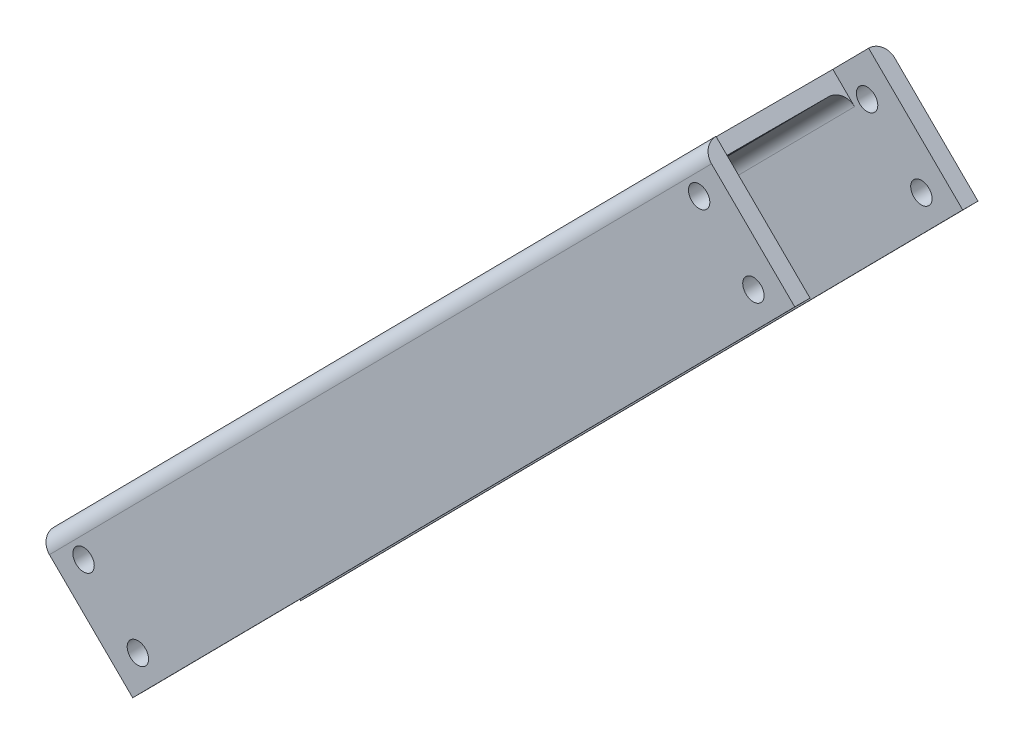
ISO-10303-21;
HEADER;
FILE_DESCRIPTION(('STEP AP214'),'2;1');
FILE_NAME('part.step','',(''),(''),'','','');
FILE_SCHEMA(('AUTOMOTIVE_DESIGN { 1 0 10303 214 1 1 1 1 }'));
ENDSEC;
DATA;
#1=APPLICATION_CONTEXT('core data for automotive mechanical design processes');
#2=APPLICATION_PROTOCOL_DEFINITION('international standard','automotive_design',2000,#1);
#3=PRODUCT_CONTEXT('',#1,'mechanical');
#4=PRODUCT('Part','Part','',(#3));
#5=PRODUCT_RELATED_PRODUCT_CATEGORY('part','',(#4));
#6=PRODUCT_DEFINITION_FORMATION('','',#4);
#7=PRODUCT_DEFINITION_CONTEXT('part definition',#1,'design');
#8=PRODUCT_DEFINITION('design','',#6,#7);
#9=PRODUCT_DEFINITION_SHAPE('','',#8);
#10=(LENGTH_UNIT() NAMED_UNIT(*) SI_UNIT(.MILLI.,.METRE.));
#11=(NAMED_UNIT(*) PLANE_ANGLE_UNIT() SI_UNIT($,.RADIAN.));
#12=(NAMED_UNIT(*) SI_UNIT($,.STERADIAN.) SOLID_ANGLE_UNIT());
#13=UNCERTAINTY_MEASURE_WITH_UNIT(LENGTH_MEASURE(1.E-05),#10,'distance_accuracy_value','');
#14=(GEOMETRIC_REPRESENTATION_CONTEXT(3) GLOBAL_UNCERTAINTY_ASSIGNED_CONTEXT((#13)) GLOBAL_UNIT_ASSIGNED_CONTEXT((#10,
#11,#12)) REPRESENTATION_CONTEXT('',''));
#15=CARTESIAN_POINT('',(0.,0.,0.));
#16=DIRECTION('',(0.,0.,1.));
#17=DIRECTION('',(1.,0.,0.));
#18=AXIS2_PLACEMENT_3D('',#15,#16,#17);
#19=CARTESIAN_POINT('',(165.715003735822,148.457007377639,-3.));
#20=DIRECTION('',(0.703127515212894,0.711063778679903,0.));
#21=DIRECTION('',(-0.711063778679903,0.703127515212894,0.));
#22=AXIS2_PLACEMENT_3D('',#19,#20,#21);
#23=PLANE('',#22);
#24=CARTESIAN_POINT('',(167.848195071861,146.347624832,-33.));
#25=DIRECTION('',(0.703127515212894,0.711063778679903,0.));
#26=DIRECTION('',(-0.711063778679903,0.703127515212894,0.));
#27=AXIS2_PLACEMENT_3D('',#24,#25,#26);
#28=CIRCLE('',#27,3.);
#29=CARTESIAN_POINT('',(167.848195071861,146.347624832,-36.));
#30=VERTEX_POINT('',#29);
#31=CARTESIAN_POINT('',(165.715003735822,148.457007377639,-33.));
#32=VERTEX_POINT('',#31);
#33=EDGE_CURVE('E159',#30,#32,#28,.T.);
#34=ORIENTED_EDGE('',*,*,#33,.T.);
#35=DIRECTION('',(0.711063778679903,-0.703127515212894,0.));
#36=VECTOR('',#35,1.);
#37=CARTESIAN_POINT('',(165.715003735822,148.457007377639,-33.));
#38=LINE('',#37,#36);
#39=CARTESIAN_POINT('',(184.202661981499,130.175691982104,-33.));
#40=VERTEX_POINT('',#39);
#41=EDGE_CURVE('E558',#32,#40,#38,.T.);
#42=ORIENTED_EDGE('',*,*,#41,.T.);
#43=DIRECTION('',(0.,0.,-1.));
#44=VECTOR('',#43,1.);
#45=CARTESIAN_POINT('',(184.202661981499,130.175691982104,-33.));
#46=LINE('',#45,#44);
#47=CARTESIAN_POINT('',(184.202661981499,130.175691982104,-36.));
#48=VERTEX_POINT('',#47);
#49=EDGE_CURVE('E565',#40,#48,#46,.T.);
#50=ORIENTED_EDGE('',*,*,#49,.T.);
#51=DIRECTION('',(0.711063778679903,-0.703127515212894,0.));
#52=VECTOR('',#51,1.);
#53=CARTESIAN_POINT('',(165.715003735822,148.457007377639,-36.));
#54=LINE('',#53,#52);
#55=EDGE_CURVE('E557',#30,#48,#54,.T.);
#56=ORIENTED_EDGE('',*,*,#55,.F.);
#57=EDGE_LOOP('',(#34,#42,#50,#56));
#58=FACE_BOUND('',#57,.T.);
#59=ADVANCED_FACE('F32',(#58),#23,.T.);
#60=CARTESIAN_POINT('',(35.6364134214364,16.9102083218567,-3.));
#61=DIRECTION('',(-0.703127515212895,-0.711063778679901,0.));
#62=DIRECTION('',(0.711063778679901,-0.703127515212895,0.));
#63=AXIS2_PLACEMENT_3D('',#60,#61,#62);
#64=PLANE('',#63);
#65=CARTESIAN_POINT('',(37.7696047574761,14.800825776218,-3.));
#66=DIRECTION('',(-0.703127515212895,-0.711063778679901,0.));
#67=DIRECTION('',(0.711063778679901,-0.703127515212895,0.));
#68=AXIS2_PLACEMENT_3D('',#65,#66,#67);
#69=CIRCLE('',#68,3.);
#70=CARTESIAN_POINT('',(37.7696047574761,14.800825776218,0.));
#71=VERTEX_POINT('',#70);
#72=CARTESIAN_POINT('',(35.6364134214364,16.9102083218567,-3.));
#73=VERTEX_POINT('',#72);
#74=EDGE_CURVE('E55',#71,#73,#69,.T.);
#75=ORIENTED_EDGE('',*,*,#74,.T.);
#76=DIRECTION('',(0.711063778679901,-0.703127515212895,0.));
#77=VECTOR('',#76,1.);
#78=CARTESIAN_POINT('',(35.6364134214364,16.9102083218567,-3.));
#79=LINE('',#78,#77);
#80=CARTESIAN_POINT('',(54.1240716671134,-1.37110707367817,-3.));
#81=VERTEX_POINT('',#80);
#82=EDGE_CURVE('E145',#73,#81,#79,.T.);
#83=ORIENTED_EDGE('',*,*,#82,.T.);
#84=DIRECTION('',(0.,0.,1.));
#85=VECTOR('',#84,1.);
#86=CARTESIAN_POINT('',(54.1240716671134,-1.37110707367817,-3.));
#87=LINE('',#86,#85);
#88=CARTESIAN_POINT('',(54.1240716671134,-1.37110707367817,0.));
#89=VERTEX_POINT('',#88);
#90=EDGE_CURVE('E580',#81,#89,#87,.T.);
#91=ORIENTED_EDGE('',*,*,#90,.T.);
#92=DIRECTION('',(0.711063778679901,-0.703127515212895,0.));
#93=VECTOR('',#92,1.);
#94=CARTESIAN_POINT('',(35.6364134214364,16.9102083218567,0.));
#95=LINE('',#94,#93);
#96=EDGE_CURVE('E582',#71,#89,#95,.T.);
#97=ORIENTED_EDGE('',*,*,#96,.F.);
#98=EDGE_LOOP('',(#75,#83,#91,#97));
#99=FACE_BOUND('',#98,.T.);
#100=ADVANCED_FACE('F211',(#99),#64,.T.);
#101=CARTESIAN_POINT('',(0.,0.,-3.));
#102=DIRECTION('',(0.,0.,1.));
#103=DIRECTION('',(1.,0.,0.));
#104=AXIS2_PLACEMENT_3D('',#101,#102,#103);
#105=PLANE('',#104);
#106=CARTESIAN_POINT('',(176.077014239216,129.069414996749,-3.));
#107=DIRECTION('',(0.,0.,1.));
#108=DIRECTION('',(1.,0.,0.));
#109=AXIS2_PLACEMENT_3D('',#106,#107,#108);
#110=CIRCLE('',#109,2.1);
#111=CARTESIAN_POINT('',(178.177014239216,129.069414996749,-3.));
#112=VERTEX_POINT('',#111);
#113=EDGE_CURVE('E518',#112,#112,#110,.T.);
#114=ORIENTED_EDGE('',*,*,#113,.T.);
#115=EDGE_LOOP('',(#114));
#116=FACE_BOUND('',#115,.T.);
#117=CARTESIAN_POINT('',(165.411057559017,139.616327724942,-3.));
#118=DIRECTION('',(0.,0.,1.));
#119=DIRECTION('',(1.,0.,0.));
#120=AXIS2_PLACEMENT_3D('',#117,#118,#119);
#121=CIRCLE('',#120,2.10000000000002);
#122=CARTESIAN_POINT('',(167.511057559017,139.616327724942,-3.));
#123=VERTEX_POINT('',#122);
#124=EDGE_CURVE('E526',#123,#123,#121,.T.);
#125=ORIENTED_EDGE('',*,*,#124,.T.);
#126=EDGE_LOOP('',(#125));
#127=FACE_BOUND('',#126,.T.);
#128=CARTESIAN_POINT('',(44.473124942399,17.3133577919994,-3.));
#129=DIRECTION('',(0.,0.,1.));
#130=DIRECTION('',(1.,0.,0.));
#131=AXIS2_PLACEMENT_3D('',#128,#129,#130);
#132=CIRCLE('',#131,2.1);
#133=CARTESIAN_POINT('',(46.573124942399,17.3133577919994,-3.));
#134=VERTEX_POINT('',#133);
#135=EDGE_CURVE('E629',#134,#134,#132,.T.);
#136=ORIENTED_EDGE('',*,*,#135,.T.);
#137=EDGE_LOOP('',(#136));
#138=FACE_BOUND('',#137,.T.);
#139=CARTESIAN_POINT('',(55.1390816225975,6.76644506380587,-3.));
#140=DIRECTION('',(0.,0.,1.));
#141=DIRECTION('',(1.,0.,0.));
#142=AXIS2_PLACEMENT_3D('',#139,#140,#141);
#143=CIRCLE('',#142,2.1);
#144=CARTESIAN_POINT('',(57.2390816225975,6.76644506380587,-3.));
#145=VERTEX_POINT('',#144);
#146=EDGE_CURVE('E635',#145,#145,#143,.T.);
#147=ORIENTED_EDGE('',*,*,#146,.T.);
#148=EDGE_LOOP('',(#147));
#149=FACE_BOUND('',#148,.T.);
#150=DIRECTION('',(-0.703127515212894,-0.711063778679903,0.));
#151=VECTOR('',#150,1.);
#152=CARTESIAN_POINT('',(169.981386407901,144.238242286361,-3.));
#153=LINE('',#152,#151);
#154=CARTESIAN_POINT('',(46.9340712456447,19.8020810173784,-3.));
#155=VERTEX_POINT('',#154);
#156=CARTESIAN_POINT('',(162.950111255772,137.127604499562,-3.));
#157=VERTEX_POINT('',#156);
#158=EDGE_CURVE('E595',#155,#157,#153,.F.);
#159=ORIENTED_EDGE('',*,*,#158,.T.);
#160=DIRECTION('',(-0.711063778679903,0.703127515212894,0.));
#161=VECTOR('',#160,1.);
#162=CARTESIAN_POINT('',(199.657197852114,100.83020985923,-3.));
#163=LINE('',#162,#161);
#164=CARTESIAN_POINT('',(158.683728583693,141.34636959084,-3.));
#165=VERTEX_POINT('',#164);
#166=EDGE_CURVE('E152',#157,#165,#163,.T.);
#167=ORIENTED_EDGE('',*,*,#166,.T.);
#168=DIRECTION('',(0.703127515212892,0.711063778679904,0.));
#169=VECTOR('',#168,1.);
#170=CARTESIAN_POINT('',(158.683728583693,141.34636959084,-3.));
#171=LINE('',#170,#169);
#172=CARTESIAN_POINT('',(165.715003735822,148.457007377639,-3.));
#173=VERTEX_POINT('',#172);
#174=EDGE_CURVE('E149',#165,#173,#171,.T.);
#175=ORIENTED_EDGE('',*,*,#174,.T.);
#176=DIRECTION('',(-0.711063778679903,0.703127515212894,0.));
#177=VECTOR('',#176,1.);
#178=CARTESIAN_POINT('',(165.715003735822,148.457007377639,-3.));
#179=LINE('',#178,#177);
#180=CARTESIAN_POINT('',(184.202661981499,130.175691982104,-3.));
#181=VERTEX_POINT('',#180);
#182=EDGE_CURVE('E135',#181,#173,#179,.T.);
#183=ORIENTED_EDGE('',*,*,#182,.F.);
#184=DIRECTION('',(0.703127515212895,0.711063778679901,0.));
#185=VECTOR('',#184,1.);
#186=CARTESIAN_POINT('',(54.1240716671134,-1.37110707367817,-3.));
#187=LINE('',#186,#185);
#188=EDGE_CURVE('E578',#81,#181,#187,.T.);
#189=ORIENTED_EDGE('',*,*,#188,.F.);
#190=ORIENTED_EDGE('',*,*,#82,.F.);
#191=DIRECTION('',(-0.703127515212894,-0.711063778679903,0.));
#192=VECTOR('',#191,1.);
#193=CARTESIAN_POINT('',(165.715003735822,148.457007377639,-3.));
#194=LINE('',#193,#192);
#195=CARTESIAN_POINT('',(42.6676885735653,24.0208461086557,-3.));
#196=VERTEX_POINT('',#195);
#197=EDGE_CURVE('E170',#73,#196,#194,.F.);
#198=ORIENTED_EDGE('',*,*,#197,.T.);
#199=DIRECTION('',(-0.711063778679903,0.703127515212894,0.));
#200=VECTOR('',#199,1.);
#201=CARTESIAN_POINT('',(83.6411578419864,-16.4953136229538,-3.));
#202=LINE('',#201,#200);
#203=EDGE_CURVE('E536',#155,#196,#202,.T.);
#204=ORIENTED_EDGE('',*,*,#203,.F.);
#205=EDGE_LOOP('',(#159,#167,#175,#183,#189,#190,#198,#204));
#206=FACE_BOUND('',#205,.T.);
#207=ADVANCED_FACE('F151',(#116,#127,#138,#149,#206),#105,.F.);
#208=ORIENTED_EDGE('',*,*,#182,.T.);
#209=CARTESIAN_POINT('',(167.848195071861,146.347624832,-3.));
#210=DIRECTION('',(0.703127515212894,0.711063778679903,0.));
#211=DIRECTION('',(-0.711063778679903,0.703127515212894,0.));
#212=AXIS2_PLACEMENT_3D('',#209,#210,#211);
#213=CIRCLE('',#212,3.);
#214=CARTESIAN_POINT('',(167.848195071861,146.347624832,0.));
#215=VERTEX_POINT('',#214);
#216=EDGE_CURVE('E140',#173,#215,#213,.T.);
#217=ORIENTED_EDGE('',*,*,#216,.T.);
#218=DIRECTION('',(-0.711063778679903,0.703127515212894,0.));
#219=VECTOR('',#218,1.);
#220=CARTESIAN_POINT('',(165.715003735822,148.457007377639,0.));
#221=LINE('',#220,#219);
#222=CARTESIAN_POINT('',(184.202661981499,130.175691982104,0.));
#223=VERTEX_POINT('',#222);
#224=EDGE_CURVE('E574',#223,#215,#221,.T.);
#225=ORIENTED_EDGE('',*,*,#224,.F.);
#226=DIRECTION('',(0.,0.,1.));
#227=VECTOR('',#226,1.);
#228=CARTESIAN_POINT('',(184.202661981499,130.175691982104,-3.));
#229=LINE('',#228,#227);
#230=EDGE_CURVE('E142',#181,#223,#229,.T.);
#231=ORIENTED_EDGE('',*,*,#230,.F.);
#232=EDGE_LOOP('',(#208,#217,#225,#231));
#233=FACE_BOUND('',#232,.T.);
#234=ADVANCED_FACE('F137',(#233),#23,.T.);
#235=CARTESIAN_POINT('',(54.1240716671134,-1.37110707367817,-3.));
#236=DIRECTION('',(0.711063778679901,-0.703127515212896,0.));
#237=DIRECTION('',(0.703127515212896,0.711063778679901,0.));
#238=AXIS2_PLACEMENT_3D('',#235,#236,#237);
#239=PLANE('',#238);
#240=DIRECTION('',(0.703127515212895,0.711063778679901,0.));
#241=VECTOR('',#240,1.);
#242=CARTESIAN_POINT('',(54.1240716671134,-1.37110707367817,0.));
#243=LINE('',#242,#241);
#244=EDGE_CURVE('E146',#89,#223,#243,.T.);
#245=ORIENTED_EDGE('',*,*,#244,.F.);
#246=ORIENTED_EDGE('',*,*,#90,.F.);
#247=ORIENTED_EDGE('',*,*,#188,.T.);
#248=ORIENTED_EDGE('',*,*,#230,.T.);
#249=EDGE_LOOP('',(#245,#246,#247,#248));
#250=FACE_BOUND('',#249,.T.);
#251=ADVANCED_FACE('F223',(#250),#239,.T.);
#252=DIRECTION('',(-0.711063778679901,0.703127515212895,0.));
#253=VECTOR('',#252,1.);
#254=CARTESIAN_POINT('',(54.1240716671134,-1.37110707367817,-33.));
#255=LINE('',#254,#253);
#256=CARTESIAN_POINT('',(54.1240716671134,-1.37110707367817,-33.));
#257=VERTEX_POINT('',#256);
#258=CARTESIAN_POINT('',(35.6364134214364,16.9102083218567,-32.9999999999998));
#259=VERTEX_POINT('',#258);
#260=EDGE_CURVE('E563',#257,#259,#255,.T.);
#261=ORIENTED_EDGE('',*,*,#260,.T.);
#262=CARTESIAN_POINT('',(37.7696047574761,14.800825776218,-33.));
#263=DIRECTION('',(-0.703127515212895,-0.711063778679901,0.));
#264=DIRECTION('',(0.711063778679901,-0.703127515212895,0.));
#265=AXIS2_PLACEMENT_3D('',#262,#263,#264);
#266=CIRCLE('',#265,3.);
#267=CARTESIAN_POINT('',(37.7696047574761,14.800825776218,-36.));
#268=VERTEX_POINT('',#267);
#269=EDGE_CURVE('E178',#259,#268,#266,.T.);
#270=ORIENTED_EDGE('',*,*,#269,.T.);
#271=DIRECTION('',(-0.711063778679901,0.703127515212895,0.));
#272=VECTOR('',#271,1.);
#273=CARTESIAN_POINT('',(54.1240716671134,-1.37110707367817,-36.));
#274=LINE('',#273,#272);
#275=CARTESIAN_POINT('',(54.1240716671134,-1.37110707367817,-36.));
#276=VERTEX_POINT('',#275);
#277=EDGE_CURVE('E561',#276,#268,#274,.T.);
#278=ORIENTED_EDGE('',*,*,#277,.F.);
#279=DIRECTION('',(0.,0.,-1.));
#280=VECTOR('',#279,1.);
#281=CARTESIAN_POINT('',(54.1240716671134,-1.37110707367817,-33.));
#282=LINE('',#281,#280);
#283=EDGE_CURVE('E572',#257,#276,#282,.T.);
#284=ORIENTED_EDGE('',*,*,#283,.F.);
#285=EDGE_LOOP('',(#261,#270,#278,#284));
#286=FACE_BOUND('',#285,.T.);
#287=ADVANCED_FACE('F219',(#286),#64,.T.);
#288=CARTESIAN_POINT('',(165.715003735822,148.457007377639,-3.));
#289=DIRECTION('',(-0.711063778679903,0.703127515212893,0.));
#290=DIRECTION('',(-0.703127515212894,-0.711063778679903,0.));
#291=AXIS2_PLACEMENT_3D('',#288,#289,#290);
#292=PLANE('',#291);
#293=CARTESIAN_POINT('',(148.136815855499,130.680412910641,-18.));
#294=DIRECTION('',(-0.711063778679903,0.703127515212893,0.));
#295=DIRECTION('',(-0.703127515212894,-0.711063778679903,0.));
#296=AXIS2_PLACEMENT_3D('',#293,#294,#295);
#297=CIRCLE('',#296,8.5);
#298=CARTESIAN_POINT('',(142.16023197619,124.636370791862,-18.));
#299=VERTEX_POINT('',#298);
#300=EDGE_CURVE('E40',#299,#299,#297,.F.);
#301=ORIENTED_EDGE('',*,*,#300,.T.);
#302=EDGE_LOOP('',(#301));
#303=FACE_BOUND('',#302,.T.);
#304=DIRECTION('',(0.,0.,1.));
#305=VECTOR('',#304,1.);
#306=CARTESIAN_POINT('',(158.683728583693,141.34636959084,-33.));
#307=LINE('',#306,#305);
#308=CARTESIAN_POINT('',(158.683728583693,141.34636959084,-33.));
#309=VERTEX_POINT('',#308);
#310=EDGE_CURVE('E47',#309,#165,#307,.T.);
#311=ORIENTED_EDGE('',*,*,#310,.F.);
#312=DIRECTION('',(0.703127515212894,0.711063778679903,0.));
#313=VECTOR('',#312,1.);
#314=CARTESIAN_POINT('',(165.715003735822,148.457007377639,-33.));
#315=LINE('',#314,#313);
#316=CARTESIAN_POINT('',(42.6676885735653,24.0208461086557,-33.));
#317=VERTEX_POINT('',#316);
#318=EDGE_CURVE('E173',#309,#317,#315,.F.);
#319=ORIENTED_EDGE('',*,*,#318,.T.);
#320=DIRECTION('',(0.,0.,-1.));
#321=VECTOR('',#320,1.);
#322=CARTESIAN_POINT('',(42.6676885735653,24.0208461086557,-33.));
#323=LINE('',#322,#321);
#324=EDGE_CURVE('E523',#196,#317,#323,.T.);
#325=ORIENTED_EDGE('',*,*,#324,.F.);
#326=EDGE_CURVE('E163',#196,#165,#194,.F.);
#327=ORIENTED_EDGE('',*,*,#326,.T.);
#328=EDGE_LOOP('',(#311,#319,#325,#327));
#329=FACE_BOUND('',#328,.T.);
#330=ADVANCED_FACE('F189',(#303,#329),#292,.T.);
#331=CARTESIAN_POINT('',(0.,0.,0.));
#332=DIRECTION('',(0.,0.,1.));
#333=DIRECTION('',(1.,0.,0.));
#334=AXIS2_PLACEMENT_3D('',#331,#332,#333);
#335=PLANE('',#334);
#336=CARTESIAN_POINT('',(176.077014239216,129.069414996749,0.));
#337=DIRECTION('',(0.,0.,1.));
#338=DIRECTION('',(1.,0.,0.));
#339=AXIS2_PLACEMENT_3D('',#336,#337,#338);
#340=CIRCLE('',#339,2.1);
#341=CARTESIAN_POINT('',(178.177014239216,129.069414996749,0.));
#342=VERTEX_POINT('',#341);
#343=EDGE_CURVE('E516',#342,#342,#340,.T.);
#344=ORIENTED_EDGE('',*,*,#343,.F.);
#345=EDGE_LOOP('',(#344));
#346=FACE_BOUND('',#345,.T.);
#347=CARTESIAN_POINT('',(165.411057559017,139.616327724942,0.));
#348=DIRECTION('',(0.,0.,1.));
#349=DIRECTION('',(1.,0.,0.));
#350=AXIS2_PLACEMENT_3D('',#347,#348,#349);
#351=CIRCLE('',#350,2.10000000000002);
#352=CARTESIAN_POINT('',(167.511057559017,139.616327724942,0.));
#353=VERTEX_POINT('',#352);
#354=EDGE_CURVE('E652',#353,#353,#351,.T.);
#355=ORIENTED_EDGE('',*,*,#354,.F.);
#356=EDGE_LOOP('',(#355));
#357=FACE_BOUND('',#356,.T.);
#358=CARTESIAN_POINT('',(44.473124942399,17.3133577919994,0.));
#359=DIRECTION('',(0.,0.,1.));
#360=DIRECTION('',(-1.,0.,0.));
#361=AXIS2_PLACEMENT_3D('',#358,#359,#360);
#362=CIRCLE('',#361,2.1);
#363=CARTESIAN_POINT('',(42.373124942399,17.3133577919994,0.));
#364=VERTEX_POINT('',#363);
#365=EDGE_CURVE('E645',#364,#364,#362,.T.);
#366=ORIENTED_EDGE('',*,*,#365,.F.);
#367=EDGE_LOOP('',(#366));
#368=FACE_BOUND('',#367,.T.);
#369=CARTESIAN_POINT('',(55.1390816225975,6.76644506380587,0.));
#370=DIRECTION('',(0.,0.,1.));
#371=DIRECTION('',(-1.,0.,0.));
#372=AXIS2_PLACEMENT_3D('',#369,#370,#371);
#373=CIRCLE('',#372,2.1);
#374=CARTESIAN_POINT('',(53.0390816225975,6.76644506380587,0.));
#375=VERTEX_POINT('',#374);
#376=EDGE_CURVE('E646',#375,#375,#373,.T.);
#377=ORIENTED_EDGE('',*,*,#376,.F.);
#378=EDGE_LOOP('',(#377));
#379=FACE_BOUND('',#378,.T.);
#380=ORIENTED_EDGE('',*,*,#224,.T.);
#381=DIRECTION('',(-0.703127515212894,-0.711063778679903,0.));
#382=VECTOR('',#381,1.);
#383=CARTESIAN_POINT('',(11.6968071912389,-11.5662577997837,0.));
#384=LINE('',#383,#382);
#385=EDGE_CURVE('E158',#215,#71,#384,.T.);
#386=ORIENTED_EDGE('',*,*,#385,.T.);
#387=ORIENTED_EDGE('',*,*,#96,.T.);
#388=ORIENTED_EDGE('',*,*,#244,.T.);
#389=EDGE_LOOP('',(#380,#386,#387,#388));
#390=FACE_BOUND('',#389,.T.);
#391=ADVANCED_FACE('F240',(#346,#357,#368,#379,#390),#335,.T.);
#392=CARTESIAN_POINT('',(37.7696047574761,14.800825776218,-220.999814062279));
#393=DIRECTION('',(-0.711063778679903,0.703127515212893,0.));
#394=DIRECTION('',(-0.703127515212894,-0.711063778679903,0.));
#395=AXIS2_PLACEMENT_3D('',#392,#393,#394);
#396=PLANE('',#395);
#397=CARTESIAN_POINT('',(150.270007191539,128.571030365002,-18.));
#398=DIRECTION('',(-0.711063778679903,0.703127515212893,0.));
#399=DIRECTION('',(-0.703127515212894,-0.711063778679903,0.));
#400=AXIS2_PLACEMENT_3D('',#397,#398,#399);
#401=CIRCLE('',#400,8.5);
#402=CARTESIAN_POINT('',(144.293423312229,122.526988246223,-18.));
#403=VERTEX_POINT('',#402);
#404=EDGE_CURVE('E11',#403,#403,#401,.T.);
#405=ORIENTED_EDGE('',*,*,#404,.T.);
#406=EDGE_LOOP('',(#405));
#407=FACE_BOUND('',#406,.T.);
#408=DIRECTION('',(-0.703127515212894,-0.711063778679903,0.));
#409=VECTOR('',#408,1.);
#410=CARTESIAN_POINT('',(167.848195071861,146.347624832,-30.));
#411=LINE('',#410,#409);
#412=CARTESIAN_POINT('',(44.800879909605,21.911463563017,-30.));
#413=VERTEX_POINT('',#412);
#414=CARTESIAN_POINT('',(160.816919919732,139.236987045201,-30.));
#415=VERTEX_POINT('',#414);
#416=EDGE_CURVE('E587',#413,#415,#411,.F.);
#417=ORIENTED_EDGE('',*,*,#416,.T.);
#418=DIRECTION('',(0.,0.,1.));
#419=VECTOR('',#418,1.);
#420=CARTESIAN_POINT('',(160.816919919732,139.236987045201,-220.999814062279));
#421=LINE('',#420,#419);
#422=CARTESIAN_POINT('',(160.816919919732,139.236987045201,-6.00000000000001));
#423=VERTEX_POINT('',#422);
#424=EDGE_CURVE('E551',#415,#423,#421,.T.);
#425=ORIENTED_EDGE('',*,*,#424,.T.);
#426=DIRECTION('',(-0.703127515212894,-0.711063778679903,0.));
#427=VECTOR('',#426,1.);
#428=CARTESIAN_POINT('',(37.7696047574761,14.800825776218,-6.00000000000001));
#429=LINE('',#428,#427);
#430=CARTESIAN_POINT('',(44.800879909605,21.911463563017,-6.00000000000001));
#431=VERTEX_POINT('',#430);
#432=EDGE_CURVE('E592',#423,#431,#429,.T.);
#433=ORIENTED_EDGE('',*,*,#432,.T.);
#434=DIRECTION('',(0.,0.,-1.));
#435=VECTOR('',#434,1.);
#436=CARTESIAN_POINT('',(44.800879909605,21.911463563017,-220.999814062279));
#437=LINE('',#436,#435);
#438=EDGE_CURVE('E542',#431,#413,#437,.T.);
#439=ORIENTED_EDGE('',*,*,#438,.T.);
#440=EDGE_LOOP('',(#417,#425,#433,#439));
#441=FACE_BOUND('',#440,.T.);
#442=ADVANCED_FACE('F238',(#407,#441),#396,.F.);
#443=CARTESIAN_POINT('',(0.,0.,-33.));
#444=DIRECTION('',(0.,0.,-1.));
#445=DIRECTION('',(-1.,0.,0.));
#446=AXIS2_PLACEMENT_3D('',#443,#444,#445);
#447=PLANE('',#446);
#448=CARTESIAN_POINT('',(176.077014239216,129.069414996749,-33.));
#449=DIRECTION('',(0.,0.,-1.));
#450=DIRECTION('',(-1.,0.,0.));
#451=AXIS2_PLACEMENT_3D('',#448,#449,#450);
#452=CIRCLE('',#451,2.1);
#453=CARTESIAN_POINT('',(173.977014239216,129.069414996749,-33.));
#454=VERTEX_POINT('',#453);
#455=EDGE_CURVE('E520',#454,#454,#452,.T.);
#456=ORIENTED_EDGE('',*,*,#455,.T.);
#457=EDGE_LOOP('',(#456));
#458=FACE_BOUND('',#457,.T.);
#459=CARTESIAN_POINT('',(165.411057559017,139.616327724942,-33.));
#460=DIRECTION('',(0.,0.,-1.));
#461=DIRECTION('',(-1.,0.,0.));
#462=AXIS2_PLACEMENT_3D('',#459,#460,#461);
#463=CIRCLE('',#462,2.10000000000002);
#464=CARTESIAN_POINT('',(163.311057559017,139.616327724942,-33.));
#465=VERTEX_POINT('',#464);
#466=EDGE_CURVE('E626',#465,#465,#463,.T.);
#467=ORIENTED_EDGE('',*,*,#466,.T.);
#468=EDGE_LOOP('',(#467));
#469=FACE_BOUND('',#468,.T.);
#470=CARTESIAN_POINT('',(44.473124942399,17.3133577919994,-33.));
#471=DIRECTION('',(0.,0.,-1.));
#472=DIRECTION('',(-1.,0.,0.));
#473=AXIS2_PLACEMENT_3D('',#470,#471,#472);
#474=CIRCLE('',#473,2.1);
#475=CARTESIAN_POINT('',(42.373124942399,17.3133577919994,-33.));
#476=VERTEX_POINT('',#475);
#477=EDGE_CURVE('E632',#476,#476,#474,.T.);
#478=ORIENTED_EDGE('',*,*,#477,.T.);
#479=EDGE_LOOP('',(#478));
#480=FACE_BOUND('',#479,.T.);
#481=CARTESIAN_POINT('',(55.1390816225975,6.76644506380587,-33.));
#482=DIRECTION('',(0.,0.,-1.));
#483=DIRECTION('',(-1.,0.,0.));
#484=AXIS2_PLACEMENT_3D('',#481,#482,#483);
#485=CIRCLE('',#484,2.1);
#486=CARTESIAN_POINT('',(53.0390816225975,6.76644506380587,-33.));
#487=VERTEX_POINT('',#486);
#488=EDGE_CURVE('E638',#487,#487,#485,.T.);
#489=ORIENTED_EDGE('',*,*,#488,.T.);
#490=EDGE_LOOP('',(#489));
#491=FACE_BOUND('',#490,.T.);
#492=ORIENTED_EDGE('',*,*,#260,.F.);
#493=DIRECTION('',(-0.703127515212895,-0.711063778679901,0.));
#494=VECTOR('',#493,1.);
#495=CARTESIAN_POINT('',(184.202661981499,130.175691982104,-33.));
#496=LINE('',#495,#494);
#497=EDGE_CURVE('E560',#40,#257,#496,.T.);
#498=ORIENTED_EDGE('',*,*,#497,.F.);
#499=ORIENTED_EDGE('',*,*,#41,.F.);
#500=EDGE_CURVE('E174',#32,#309,#315,.F.);
#501=ORIENTED_EDGE('',*,*,#500,.T.);
#502=DIRECTION('',(-0.711063778679903,0.703127515212894,0.));
#503=VECTOR('',#502,1.);
#504=CARTESIAN_POINT('',(199.657197852114,100.83020985923,-33.));
#505=LINE('',#504,#503);
#506=CARTESIAN_POINT('',(162.950111255772,137.127604499562,-33.));
#507=VERTEX_POINT('',#506);
#508=EDGE_CURVE('E155',#507,#309,#505,.T.);
#509=ORIENTED_EDGE('',*,*,#508,.F.);
#510=DIRECTION('',(-0.703127515212894,-0.711063778679903,0.));
#511=VECTOR('',#510,1.);
#512=CARTESIAN_POINT('',(39.9027960935158,12.6914432305793,-33.));
#513=LINE('',#512,#511);
#514=CARTESIAN_POINT('',(46.9340712456447,19.8020810173783,-32.9999999999998));
#515=VERTEX_POINT('',#514);
#516=EDGE_CURVE('E166',#507,#515,#513,.T.);
#517=ORIENTED_EDGE('',*,*,#516,.T.);
#518=DIRECTION('',(-0.711063778679903,0.703127515212894,0.));
#519=VECTOR('',#518,1.);
#520=CARTESIAN_POINT('',(83.6411578419864,-16.4953136229538,-33.));
#521=LINE('',#520,#519);
#522=EDGE_CURVE('E531',#515,#317,#521,.T.);
#523=ORIENTED_EDGE('',*,*,#522,.T.);
#524=DIRECTION('',(-0.703127515212893,-0.711063778679903,0.));
#525=VECTOR('',#524,1.);
#526=CARTESIAN_POINT('',(35.6364134214364,16.9102083218567,-32.9999999999998));
#527=LINE('',#526,#525);
#528=EDGE_CURVE('E519',#317,#259,#527,.T.);
#529=ORIENTED_EDGE('',*,*,#528,.T.);
#530=EDGE_LOOP('',(#492,#498,#499,#501,#509,#517,#523,#529));
#531=FACE_BOUND('',#530,.T.);
#532=ADVANCED_FACE('F262',(#458,#469,#480,#491,#531),#447,.F.);
#533=CARTESIAN_POINT('',(184.202661981499,130.175691982104,-33.));
#534=DIRECTION('',(0.711063778679901,-0.703127515212896,0.));
#535=DIRECTION('',(0.703127515212896,0.711063778679901,0.));
#536=AXIS2_PLACEMENT_3D('',#533,#534,#535);
#537=PLANE('',#536);
#538=DIRECTION('',(-0.703127515212895,-0.711063778679901,0.));
#539=VECTOR('',#538,1.);
#540=CARTESIAN_POINT('',(184.202661981499,130.175691982104,-36.));
#541=LINE('',#540,#539);
#542=EDGE_CURVE('E567',#48,#276,#541,.T.);
#543=ORIENTED_EDGE('',*,*,#542,.F.);
#544=ORIENTED_EDGE('',*,*,#49,.F.);
#545=ORIENTED_EDGE('',*,*,#497,.T.);
#546=ORIENTED_EDGE('',*,*,#283,.T.);
#547=EDGE_LOOP('',(#543,#544,#545,#546));
#548=FACE_BOUND('',#547,.T.);
#549=ADVANCED_FACE('F269',(#548),#537,.T.);
#550=CARTESIAN_POINT('',(0.,0.,-36.));
#551=DIRECTION('',(0.,0.,-1.));
#552=DIRECTION('',(-1.,0.,0.));
#553=AXIS2_PLACEMENT_3D('',#550,#551,#552);
#554=PLANE('',#553);
#555=CARTESIAN_POINT('',(176.077014239216,129.069414996749,-36.));
#556=DIRECTION('',(0.,0.,-1.));
#557=DIRECTION('',(-1.,0.,0.));
#558=AXIS2_PLACEMENT_3D('',#555,#556,#557);
#559=CIRCLE('',#558,2.1);
#560=CARTESIAN_POINT('',(173.977014239216,129.069414996749,-36.));
#561=VERTEX_POINT('',#560);
#562=EDGE_CURVE('E641',#561,#561,#559,.F.);
#563=ORIENTED_EDGE('',*,*,#562,.T.);
#564=EDGE_LOOP('',(#563));
#565=FACE_BOUND('',#564,.T.);
#566=CARTESIAN_POINT('',(165.411057559017,139.616327724942,-36.));
#567=DIRECTION('',(0.,0.,-1.));
#568=DIRECTION('',(-1.,0.,0.));
#569=AXIS2_PLACEMENT_3D('',#566,#567,#568);
#570=CIRCLE('',#569,2.10000000000002);
#571=CARTESIAN_POINT('',(163.311057559017,139.616327724942,-36.));
#572=VERTEX_POINT('',#571);
#573=EDGE_CURVE('E655',#572,#572,#570,.F.);
#574=ORIENTED_EDGE('',*,*,#573,.T.);
#575=EDGE_LOOP('',(#574));
#576=FACE_BOUND('',#575,.T.);
#577=CARTESIAN_POINT('',(44.473124942399,17.3133577919994,-36.));
#578=DIRECTION('',(0.,0.,-1.));
#579=DIRECTION('',(-1.,0.,0.));
#580=AXIS2_PLACEMENT_3D('',#577,#578,#579);
#581=CIRCLE('',#580,2.1);
#582=CARTESIAN_POINT('',(42.373124942399,17.3133577919994,-36.));
#583=VERTEX_POINT('',#582);
#584=EDGE_CURVE('E649',#583,#583,#581,.F.);
#585=ORIENTED_EDGE('',*,*,#584,.T.);
#586=EDGE_LOOP('',(#585));
#587=FACE_BOUND('',#586,.T.);
#588=CARTESIAN_POINT('',(55.1390816225975,6.76644506380587,-36.));
#589=DIRECTION('',(0.,0.,-1.));
#590=DIRECTION('',(-1.,0.,0.));
#591=AXIS2_PLACEMENT_3D('',#588,#589,#590);
#592=CIRCLE('',#591,2.1);
#593=CARTESIAN_POINT('',(53.0390816225975,6.76644506380587,-36.));
#594=VERTEX_POINT('',#593);
#595=EDGE_CURVE('E642',#594,#594,#592,.F.);
#596=ORIENTED_EDGE('',*,*,#595,.T.);
#597=EDGE_LOOP('',(#596));
#598=FACE_BOUND('',#597,.T.);
#599=ORIENTED_EDGE('',*,*,#277,.T.);
#600=DIRECTION('',(0.703127515212894,0.711063778679903,0.));
#601=VECTOR('',#600,1.);
#602=CARTESIAN_POINT('',(11.6968071912389,-11.5662577997837,-36.));
#603=LINE('',#602,#601);
#604=EDGE_CURVE('E160',#268,#30,#603,.T.);
#605=ORIENTED_EDGE('',*,*,#604,.T.);
#606=ORIENTED_EDGE('',*,*,#55,.T.);
#607=ORIENTED_EDGE('',*,*,#542,.T.);
#608=EDGE_LOOP('',(#599,#605,#606,#607));
#609=FACE_BOUND('',#608,.T.);
#610=ADVANCED_FACE('F278',(#565,#576,#587,#598,#609),#554,.T.);
#611=CARTESIAN_POINT('',(39.9027960935158,12.6914432305793,-6.00000000000001));
#612=DIRECTION('',(0.703127515212894,0.711063778679903,0.));
#613=DIRECTION('',(-0.711063778679903,0.703127515212894,0.));
#614=AXIS2_PLACEMENT_3D('',#611,#612,#613);
#615=CYLINDRICAL_SURFACE('',#614,3.);
#616=ORIENTED_EDGE('',*,*,#432,.F.);
#617=CARTESIAN_POINT('',(162.950111255772,137.127604499562,-6.00000000000001));
#618=DIRECTION('',(-0.703127515212894,-0.711063778679903,0.));
#619=DIRECTION('',(0.711063778679903,-0.703127515212894,0.));
#620=AXIS2_PLACEMENT_3D('',#617,#618,#619);
#621=CIRCLE('',#620,3.);
#622=EDGE_CURVE('E554',#423,#157,#621,.F.);
#623=ORIENTED_EDGE('',*,*,#622,.T.);
#624=ORIENTED_EDGE('',*,*,#158,.F.);
#625=CARTESIAN_POINT('',(46.9340712456447,19.8020810173784,-6.00000000000001));
#626=DIRECTION('',(0.703127515212894,0.711063778679903,0.));
#627=DIRECTION('',(-0.711063778679903,0.703127515212894,0.));
#628=AXIS2_PLACEMENT_3D('',#625,#626,#627);
#629=CIRCLE('',#628,3.);
#630=EDGE_CURVE('E545',#155,#431,#629,.F.);
#631=ORIENTED_EDGE('',*,*,#630,.T.);
#632=EDGE_LOOP('',(#616,#623,#624,#631));
#633=FACE_BOUND('',#632,.T.);
#634=ADVANCED_FACE('F285',(#633),#615,.F.);
#635=CARTESIAN_POINT('',(13.8299985272786,-13.6756403454224,-30.));
#636=DIRECTION('',(0.703127515212894,0.711063778679903,0.));
#637=DIRECTION('',(-0.711063778679903,0.703127515212894,0.));
#638=AXIS2_PLACEMENT_3D('',#635,#636,#637);
#639=CYLINDRICAL_SURFACE('',#638,3.);
#640=ORIENTED_EDGE('',*,*,#516,.F.);
#641=CARTESIAN_POINT('',(162.950111255772,137.127604499562,-30.));
#642=DIRECTION('',(-0.703127515212894,-0.711063778679903,0.));
#643=DIRECTION('',(0.711063778679903,-0.703127515212894,0.));
#644=AXIS2_PLACEMENT_3D('',#641,#642,#643);
#645=CIRCLE('',#644,3.);
#646=EDGE_CURVE('E548',#507,#415,#645,.F.);
#647=ORIENTED_EDGE('',*,*,#646,.T.);
#648=ORIENTED_EDGE('',*,*,#416,.F.);
#649=CARTESIAN_POINT('',(46.9340712456447,19.8020810173783,-30.));
#650=DIRECTION('',(0.703127515212894,0.711063778679903,0.));
#651=DIRECTION('',(-0.711063778679903,0.703127515212894,0.));
#652=AXIS2_PLACEMENT_3D('',#649,#650,#651);
#653=CIRCLE('',#652,3.);
#654=EDGE_CURVE('E533',#413,#515,#653,.F.);
#655=ORIENTED_EDGE('',*,*,#654,.T.);
#656=EDGE_LOOP('',(#640,#647,#648,#655));
#657=FACE_BOUND('',#656,.T.);
#658=ADVANCED_FACE('F293',(#657),#639,.F.);
#659=CARTESIAN_POINT('',(11.6968071912389,-11.5662577997837,-33.));
#660=DIRECTION('',(0.703127515212894,0.711063778679903,0.));
#661=DIRECTION('',(-0.711063778679903,0.703127515212894,0.));
#662=AXIS2_PLACEMENT_3D('',#659,#660,#661);
#663=CYLINDRICAL_SURFACE('',#662,3.);
#664=ORIENTED_EDGE('',*,*,#269,.F.);
#665=ORIENTED_EDGE('',*,*,#528,.F.);
#666=ORIENTED_EDGE('',*,*,#318,.F.);
#667=ORIENTED_EDGE('',*,*,#500,.F.);
#668=ORIENTED_EDGE('',*,*,#33,.F.);
#669=ORIENTED_EDGE('',*,*,#604,.F.);
#670=EDGE_LOOP('',(#664,#665,#666,#667,#668,#669));
#671=FACE_BOUND('',#670,.T.);
#672=ADVANCED_FACE('F300',(#671),#663,.T.);
#673=CARTESIAN_POINT('',(11.6968071912389,-11.5662577997837,-3.));
#674=DIRECTION('',(-0.703127515212894,-0.711063778679903,0.));
#675=DIRECTION('',(0.711063778679903,-0.703127515212894,0.));
#676=AXIS2_PLACEMENT_3D('',#673,#674,#675);
#677=CYLINDRICAL_SURFACE('',#676,3.);
#678=ORIENTED_EDGE('',*,*,#216,.F.);
#679=ORIENTED_EDGE('',*,*,#174,.F.);
#680=ORIENTED_EDGE('',*,*,#326,.F.);
#681=ORIENTED_EDGE('',*,*,#197,.F.);
#682=ORIENTED_EDGE('',*,*,#74,.F.);
#683=ORIENTED_EDGE('',*,*,#385,.F.);
#684=EDGE_LOOP('',(#678,#679,#680,#681,#682,#683));
#685=FACE_BOUND('',#684,.T.);
#686=ADVANCED_FACE('F157',(#685),#677,.T.);
#687=CARTESIAN_POINT('',(165.35394778436,113.655443343626,-18.));
#688=DIRECTION('',(-0.711063778679903,0.703127515212894,0.));
#689=DIRECTION('',(-0.703127515212894,-0.711063778679903,0.));
#690=AXIS2_PLACEMENT_3D('',#687,#688,#689);
#691=CYLINDRICAL_SURFACE('',#690,7.5);
#692=CARTESIAN_POINT('',(148.847879634179,129.977285395428,-18.));
#693=DIRECTION('',(-0.711063778679903,0.703127515212893,0.));
#694=DIRECTION('',(-0.703127515212894,-0.711063778679903,0.));
#695=AXIS2_PLACEMENT_3D('',#692,#693,#694);
#696=CIRCLE('',#695,7.5);
#697=CARTESIAN_POINT('',(143.574423270082,124.644307055329,-18.));
#698=VERTEX_POINT('',#697);
#699=EDGE_CURVE('E184',#698,#698,#696,.T.);
#700=ORIENTED_EDGE('',*,*,#699,.T.);
#701=EDGE_LOOP('',(#700));
#702=FACE_BOUND('',#701,.T.);
#703=CARTESIAN_POINT('',(149.558943412859,129.274157880215,-18.));
#704=DIRECTION('',(-0.711063778679903,0.703127515212893,0.));
#705=DIRECTION('',(-0.703127515212894,-0.711063778679903,0.));
#706=AXIS2_PLACEMENT_3D('',#703,#704,#705);
#707=CIRCLE('',#706,7.5);
#708=CARTESIAN_POINT('',(144.285487048762,123.941179540116,-18.));
#709=VERTEX_POINT('',#708);
#710=EDGE_CURVE('E181',#709,#709,#707,.F.);
#711=ORIENTED_EDGE('',*,*,#710,.T.);
#712=EDGE_LOOP('',(#711));
#713=FACE_BOUND('',#712,.T.);
#714=ADVANCED_FACE('F198',(#702,#713),#691,.F.);
#715=CARTESIAN_POINT('',(83.6411578419864,-16.4953136229538,-33.));
#716=DIRECTION('',(0.703127515212894,0.711063778679903,0.));
#717=DIRECTION('',(-0.711063778679903,0.703127515212894,0.));
#718=AXIS2_PLACEMENT_3D('',#715,#716,#717);
#719=PLANE('',#718);
#720=ORIENTED_EDGE('',*,*,#203,.T.);
#721=ORIENTED_EDGE('',*,*,#324,.T.);
#722=ORIENTED_EDGE('',*,*,#522,.F.);
#723=ORIENTED_EDGE('',*,*,#654,.F.);
#724=ORIENTED_EDGE('',*,*,#438,.F.);
#725=ORIENTED_EDGE('',*,*,#630,.F.);
#726=EDGE_LOOP('',(#720,#721,#722,#723,#724,#725));
#727=FACE_BOUND('',#726,.T.);
#728=ADVANCED_FACE('F201',(#727),#719,.F.);
#729=CARTESIAN_POINT('',(199.657197852114,100.83020985923,-33.));
#730=DIRECTION('',(-0.703127515212894,-0.711063778679903,0.));
#731=DIRECTION('',(0.711063778679903,-0.703127515212894,0.));
#732=AXIS2_PLACEMENT_3D('',#729,#730,#731);
#733=PLANE('',#732);
#734=ORIENTED_EDGE('',*,*,#424,.F.);
#735=ORIENTED_EDGE('',*,*,#646,.F.);
#736=ORIENTED_EDGE('',*,*,#508,.T.);
#737=ORIENTED_EDGE('',*,*,#310,.T.);
#738=ORIENTED_EDGE('',*,*,#166,.F.);
#739=ORIENTED_EDGE('',*,*,#622,.F.);
#740=EDGE_LOOP('',(#734,#735,#736,#737,#738,#739));
#741=FACE_BOUND('',#740,.T.);
#742=ADVANCED_FACE('F325',(#741),#733,.F.);
#743=CARTESIAN_POINT('',(55.1390816225975,6.76644506380587,-41.9396969619671));
#744=DIRECTION('',(0.,0.,1.));
#745=DIRECTION('',(1.,0.,0.));
#746=AXIS2_PLACEMENT_3D('',#743,#744,#745);
#747=CYLINDRICAL_SURFACE('',#746,2.1);
#748=ORIENTED_EDGE('',*,*,#595,.F.);
#749=EDGE_LOOP('',(#748));
#750=FACE_BOUND('',#749,.T.);
#751=ORIENTED_EDGE('',*,*,#488,.F.);
#752=EDGE_LOOP('',(#751));
#753=FACE_BOUND('',#752,.T.);
#754=ADVANCED_FACE('F333',(#750,#753),#747,.F.);
#755=CARTESIAN_POINT('',(44.473124942399,17.3133577919994,-41.9396969619671));
#756=DIRECTION('',(0.,0.,1.));
#757=DIRECTION('',(1.,0.,0.));
#758=AXIS2_PLACEMENT_3D('',#755,#756,#757);
#759=CYLINDRICAL_SURFACE('',#758,2.1);
#760=ORIENTED_EDGE('',*,*,#584,.F.);
#761=EDGE_LOOP('',(#760));
#762=FACE_BOUND('',#761,.T.);
#763=ORIENTED_EDGE('',*,*,#477,.F.);
#764=EDGE_LOOP('',(#763));
#765=FACE_BOUND('',#764,.T.);
#766=ADVANCED_FACE('F339',(#762,#765),#759,.F.);
#767=CARTESIAN_POINT('',(165.411057559017,139.616327724942,-41.9396969619671));
#768=DIRECTION('',(0.,0.,1.));
#769=DIRECTION('',(1.,0.,0.));
#770=AXIS2_PLACEMENT_3D('',#767,#768,#769);
#771=CYLINDRICAL_SURFACE('',#770,2.10000000000002);
#772=ORIENTED_EDGE('',*,*,#573,.F.);
#773=EDGE_LOOP('',(#772));
#774=FACE_BOUND('',#773,.T.);
#775=ORIENTED_EDGE('',*,*,#466,.F.);
#776=EDGE_LOOP('',(#775));
#777=FACE_BOUND('',#776,.T.);
#778=ADVANCED_FACE('F348',(#774,#777),#771,.F.);
#779=CARTESIAN_POINT('',(176.077014239216,129.069414996749,-41.9396969619671));
#780=DIRECTION('',(0.,0.,1.));
#781=DIRECTION('',(1.,0.,0.));
#782=AXIS2_PLACEMENT_3D('',#779,#780,#781);
#783=CYLINDRICAL_SURFACE('',#782,2.1);
#784=ORIENTED_EDGE('',*,*,#562,.F.);
#785=EDGE_LOOP('',(#784));
#786=FACE_BOUND('',#785,.T.);
#787=ORIENTED_EDGE('',*,*,#455,.F.);
#788=EDGE_LOOP('',(#787));
#789=FACE_BOUND('',#788,.T.);
#790=ADVANCED_FACE('F357',(#786,#789),#783,.F.);
#791=ORIENTED_EDGE('',*,*,#376,.T.);
#792=EDGE_LOOP('',(#791));
#793=FACE_BOUND('',#792,.T.);
#794=ORIENTED_EDGE('',*,*,#146,.F.);
#795=EDGE_LOOP('',(#794));
#796=FACE_BOUND('',#795,.T.);
#797=ADVANCED_FACE('F342',(#793,#796),#747,.F.);
#798=ORIENTED_EDGE('',*,*,#365,.T.);
#799=EDGE_LOOP('',(#798));
#800=FACE_BOUND('',#799,.T.);
#801=ORIENTED_EDGE('',*,*,#135,.F.);
#802=EDGE_LOOP('',(#801));
#803=FACE_BOUND('',#802,.T.);
#804=ADVANCED_FACE('F351',(#800,#803),#759,.F.);
#805=ORIENTED_EDGE('',*,*,#354,.T.);
#806=EDGE_LOOP('',(#805));
#807=FACE_BOUND('',#806,.T.);
#808=ORIENTED_EDGE('',*,*,#124,.F.);
#809=EDGE_LOOP('',(#808));
#810=FACE_BOUND('',#809,.T.);
#811=ADVANCED_FACE('F360',(#807,#810),#771,.F.);
#812=ORIENTED_EDGE('',*,*,#343,.T.);
#813=EDGE_LOOP('',(#812));
#814=FACE_BOUND('',#813,.T.);
#815=ORIENTED_EDGE('',*,*,#113,.F.);
#816=EDGE_LOOP('',(#815));
#817=FACE_BOUND('',#816,.T.);
#818=ADVANCED_FACE('F195',(#814,#817),#783,.F.);
#819=CARTESIAN_POINT('',(148.847879634179,129.977285395428,-18.));
#820=DIRECTION('',(-0.711063778679903,0.703127515212893,0.));
#821=DIRECTION('',(-0.703127515212894,-0.711063778679903,0.));
#822=AXIS2_PLACEMENT_3D('',#819,#820,#821);
#823=TOROIDAL_SURFACE('',#822,8.5,1.);
#824=ORIENTED_EDGE('',*,*,#300,.F.);
#825=EDGE_LOOP('',(#824));
#826=FACE_BOUND('',#825,.T.);
#827=ORIENTED_EDGE('',*,*,#699,.F.);
#828=EDGE_LOOP('',(#827));
#829=FACE_BOUND('',#828,.T.);
#830=ADVANCED_FACE('F192',(#826,#829),#823,.T.);
#831=CARTESIAN_POINT('',(149.558943412859,129.274157880215,-18.));
#832=DIRECTION('',(-0.711063778679903,0.703127515212893,0.));
#833=DIRECTION('',(-0.703127515212894,-0.711063778679903,0.));
#834=AXIS2_PLACEMENT_3D('',#831,#832,#833);
#835=TOROIDAL_SURFACE('',#834,8.5,1.);
#836=ORIENTED_EDGE('',*,*,#404,.F.);
#837=EDGE_LOOP('',(#836));
#838=FACE_BOUND('',#837,.T.);
#839=ORIENTED_EDGE('',*,*,#710,.F.);
#840=EDGE_LOOP('',(#839));
#841=FACE_BOUND('',#840,.T.);
#842=ADVANCED_FACE('F34',(#838,#841),#835,.T.);
#843=CLOSED_SHELL('',(#59,#100,#207,#234,#251,#287,#330,#391,#442,#532,#549,#610,#634,#658,#672,
#686,#714,#728,#742,#754,#766,#778,#790,#797,#804,#811,#818,#830,#842));
#844=MANIFOLD_SOLID_BREP('B2',#843);
#845=ADVANCED_BREP_SHAPE_REPRESENTATION('',(#18,#844),#14);
#846=SHAPE_DEFINITION_REPRESENTATION(#9,#845);
ENDSEC;
END-ISO-10303-21;
